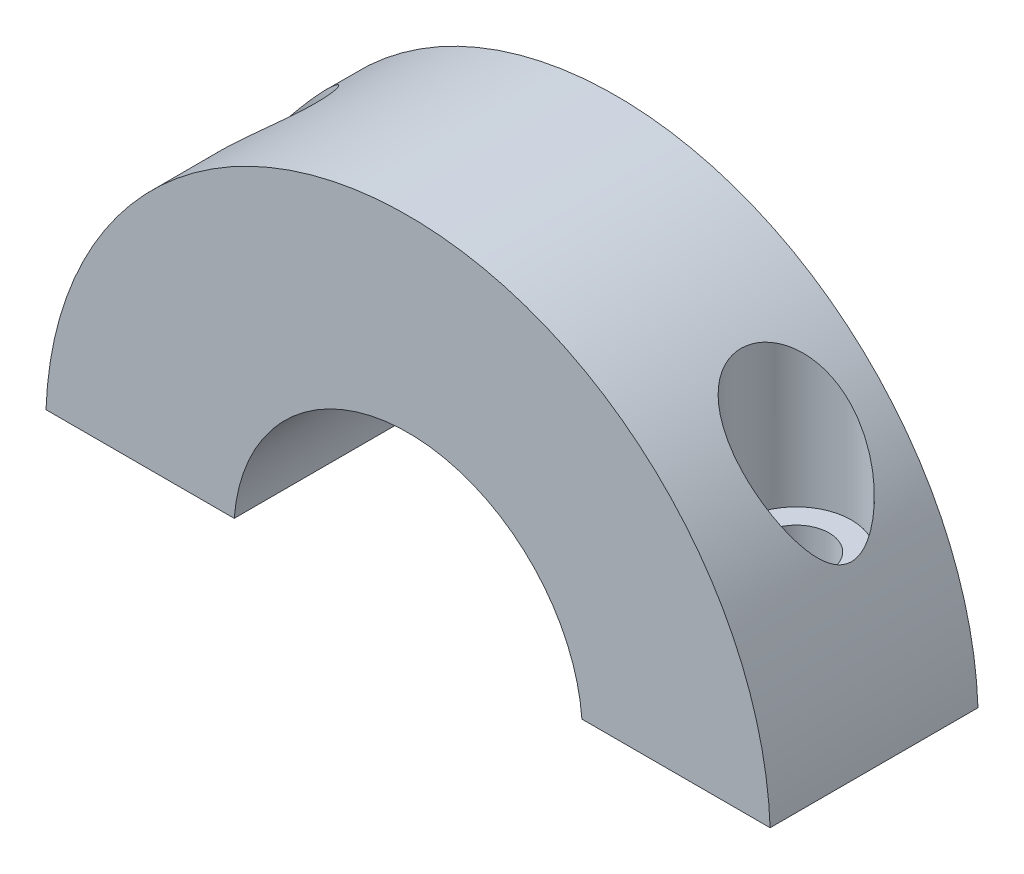
ISO-10303-21;
HEADER;
FILE_DESCRIPTION(('STEP AP214'),'2;1');
FILE_NAME('part.step','',(''),(''),'','','');
FILE_SCHEMA(('AUTOMOTIVE_DESIGN { 1 0 10303 214 1 1 1 1 }'));
ENDSEC;
DATA;
#1=APPLICATION_CONTEXT('core data for automotive mechanical design processes');
#2=APPLICATION_PROTOCOL_DEFINITION('international standard','automotive_design',2000,#1);
#3=PRODUCT_CONTEXT('',#1,'mechanical');
#4=PRODUCT('Part','Part','',(#3));
#5=PRODUCT_RELATED_PRODUCT_CATEGORY('part','',(#4));
#6=PRODUCT_DEFINITION_FORMATION('','',#4);
#7=PRODUCT_DEFINITION_CONTEXT('part definition',#1,'design');
#8=PRODUCT_DEFINITION('design','',#6,#7);
#9=PRODUCT_DEFINITION_SHAPE('','',#8);
#10=(LENGTH_UNIT() NAMED_UNIT(*) SI_UNIT(.MILLI.,.METRE.));
#11=(NAMED_UNIT(*) PLANE_ANGLE_UNIT() SI_UNIT($,.RADIAN.));
#12=(NAMED_UNIT(*) SI_UNIT($,.STERADIAN.) SOLID_ANGLE_UNIT());
#13=UNCERTAINTY_MEASURE_WITH_UNIT(LENGTH_MEASURE(1.E-05),#10,'distance_accuracy_value','');
#14=(GEOMETRIC_REPRESENTATION_CONTEXT(3) GLOBAL_UNCERTAINTY_ASSIGNED_CONTEXT((#13)) GLOBAL_UNIT_ASSIGNED_CONTEXT((#10,
#11,#12)) REPRESENTATION_CONTEXT('',''));
#15=CARTESIAN_POINT('',(0.,0.,0.));
#16=DIRECTION('',(0.,0.,1.));
#17=DIRECTION('',(1.,0.,0.));
#18=AXIS2_PLACEMENT_3D('',#15,#16,#17);
#19=CARTESIAN_POINT('',(0.,62.,8.));
#20=DIRECTION('',(0.,0.,-1.));
#21=DIRECTION('',(-1.,0.,0.));
#22=AXIS2_PLACEMENT_3D('',#19,#20,#21);
#23=CYLINDRICAL_SURFACE('',#22,27.536401);
#24=DIRECTION('',(0.,0.,-1.));
#25=VECTOR('',#24,1.);
#26=CARTESIAN_POINT('',(-27.5182372261161,63.,8.));
#27=LINE('',#26,#25);
#28=CARTESIAN_POINT('',(-27.5182372261161,63.,7.8));
#29=VERTEX_POINT('',#28);
#30=CARTESIAN_POINT('',(-27.5182372261161,63.,-8.));
#31=VERTEX_POINT('',#30);
#32=EDGE_CURVE('E51',#29,#31,#27,.T.);
#33=ORIENTED_EDGE('',*,*,#32,.F.);
#34=CARTESIAN_POINT('',(0.,62.,7.8));
#35=DIRECTION('',(0.,0.,1.));
#36=DIRECTION('',(1.,0.,0.));
#37=AXIS2_PLACEMENT_3D('',#34,#35,#36);
#38=CIRCLE('',#37,27.536401);
#39=CARTESIAN_POINT('',(27.5182372261161,63.,7.8));
#40=VERTEX_POINT('',#39);
#41=EDGE_CURVE('E89',#40,#29,#38,.T.);
#42=ORIENTED_EDGE('',*,*,#41,.F.);
#43=DIRECTION('',(0.,0.,-1.));
#44=VECTOR('',#43,1.);
#45=CARTESIAN_POINT('',(27.5182372261161,63.,8.));
#46=LINE('',#45,#44);
#47=CARTESIAN_POINT('',(27.5182372261161,63.,-8.));
#48=VERTEX_POINT('',#47);
#49=EDGE_CURVE('E11',#40,#48,#46,.T.);
#50=ORIENTED_EDGE('',*,*,#49,.T.);
#51=CARTESIAN_POINT('',(0.,62.,-8.));
#52=DIRECTION('',(0.,0.,1.));
#53=DIRECTION('',(1.,0.,0.));
#54=AXIS2_PLACEMENT_3D('',#51,#52,#53);
#55=CIRCLE('',#54,27.536401);
#56=EDGE_CURVE('E91',#48,#31,#55,.T.);
#57=ORIENTED_EDGE('',*,*,#56,.T.);
#58=EDGE_LOOP('',(#33,#42,#50,#57));
#59=FACE_BOUND('',#58,.T.);
#60=CARTESIAN_POINT('',(20.3554108455631,80.5448275629927,2.85));
#61=CARTESIAN_POINT('',(20.1170856780255,80.8064138873863,2.85000491122155));
#62=CARTESIAN_POINT('',(19.8734882162015,81.0636182927769,2.82976416768837));
#63=CARTESIAN_POINT('',(19.380286353609,81.5648000280252,2.74290249329211));
#64=CARTESIAN_POINT('',(19.1306778279491,81.8087678783834,2.67624878382171));
#65=CARTESIAN_POINT('',(18.668615235094,82.2440637222647,2.5031203518999));
#66=CARTESIAN_POINT('',(18.4559531339109,82.4379299118321,2.40370442704971));
#67=CARTESIAN_POINT('',(18.0390312266731,82.8068229357384,2.1617422833961));
#68=CARTESIAN_POINT('',(17.8347594094006,82.9818773255289,2.01926034783478));
#69=CARTESIAN_POINT('',(17.4817471963152,83.2763784605357,1.71997945018841));
#70=CARTESIAN_POINT('',(17.3298636914924,83.4000544056243,1.57114748672686));
#71=CARTESIAN_POINT('',(17.1160765193174,83.5708530588488,1.32554406533209));
#72=CARTESIAN_POINT('',(17.0471232526477,83.6253566578556,1.23990255568893));
#73=CARTESIAN_POINT('',(16.9148272837995,83.7289907125216,1.06137109727708));
#74=CARTESIAN_POINT('',(16.8514820201815,83.7781236236596,0.968484494532941));
#75=CARTESIAN_POINT('',(16.7307823766533,83.870989068267,0.774900709801326));
#76=CARTESIAN_POINT('',(16.6734900401528,83.9146663806434,0.67413820448889));
#77=CARTESIAN_POINT('',(16.566605094783,83.995578387015,0.466206146089017));
#78=CARTESIAN_POINT('',(16.5170083527228,84.0328165406263,0.359040075403063));
#79=CARTESIAN_POINT('',(16.4264488870721,84.1004152152436,0.139092111326543));
#80=CARTESIAN_POINT('',(16.3854819970795,84.1307790556276,0.0263129605359359));
#81=CARTESIAN_POINT('',(16.3130081760781,84.1842551938385,-0.203904657080799));
#82=CARTESIAN_POINT('',(16.2814993810062,84.2073689206055,-0.321342200628196));
#83=CARTESIAN_POINT('',(16.2325691618508,84.2431529199722,-0.541930864079826));
#84=CARTESIAN_POINT('',(16.2137487202528,84.2568657606456,-0.644605517233662));
#85=CARTESIAN_POINT('',(16.1837700874471,84.2786739266966,-0.851652330382076));
#86=CARTESIAN_POINT('',(16.1726109700414,84.2867699311101,-0.956024283623202));
#87=CARTESIAN_POINT('',(16.1581498244615,84.2972566544237,-1.16554735382866));
#88=CARTESIAN_POINT('',(16.1548441716258,84.299650005309,-1.27069808886892));
#89=CARTESIAN_POINT('',(16.1561361349395,84.2987139979019,-1.48092278105756));
#90=CARTESIAN_POINT('',(16.1607334444733,84.295384861628,-1.58599674102639));
#91=CARTESIAN_POINT('',(16.1770345299133,84.2835595351157,-1.78634999472077));
#92=CARTESIAN_POINT('',(16.1881065931376,84.2755225618938,-1.88170830509568));
#93=CARTESIAN_POINT('',(16.2166427934159,84.2547563202577,-2.07095401251112));
#94=CARTESIAN_POINT('',(16.2341089266851,84.2420255864524,-2.16484094063323));
#95=CARTESIAN_POINT('',(16.2957528383696,84.1969474904657,-2.44324923268322));
#96=CARTESIAN_POINT('',(16.349193828075,84.1577016509412,-2.6247277767167));
#97=CARTESIAN_POINT('',(16.4792657060671,84.0611378229269,-2.97844031862068));
#98=CARTESIAN_POINT('',(16.5563557551187,84.0034609667016,-3.15040356985124));
#99=CARTESIAN_POINT('',(16.7295511915867,83.8720665960674,-3.47778189550233));
#100=CARTESIAN_POINT('',(16.8256620861616,83.7983444353986,-3.63319215719706));
#101=CARTESIAN_POINT('',(17.0439826397396,83.6281551466352,-3.94109392597375));
#102=CARTESIAN_POINT('',(17.1678835801563,83.5300995007122,-4.09149978296373));
#103=CARTESIAN_POINT('',(17.4289209882972,83.319341964941,-4.36860392403431));
#104=CARTESIAN_POINT('',(17.566066148701,83.2066304388439,-4.49528647511208));
#105=CARTESIAN_POINT('',(17.9172985887685,82.9116787110772,-4.78053124604048));
#106=CARTESIAN_POINT('',(18.1366375684362,82.72209166657,-4.92507334204503));
#107=CARTESIAN_POINT('',(18.5831730361553,82.3226282204481,-5.16626154425809));
#108=CARTESIAN_POINT('',(18.8103844276671,82.1127118143169,-5.26281082321963));
#109=CARTESIAN_POINT('',(19.191965743328,81.7476033699204,-5.38892002801711));
#110=CARTESIAN_POINT('',(19.3464463068178,81.5963205368177,-5.43002494451777));
#111=CARTESIAN_POINT('',(19.6536964697715,81.2881543021489,-5.49393867753899));
#112=CARTESIAN_POINT('',(19.8064654490179,81.131268951498,-5.51674106064946));
#113=CARTESIAN_POINT('',(20.1091292237962,80.8128850412707,-5.54553219762963));
#114=CARTESIAN_POINT('',(20.2590197107308,80.6513803492698,-5.55149744281213));
#115=CARTESIAN_POINT('',(20.5547658069414,80.3249422348918,-5.54787148886979));
#116=CARTESIAN_POINT('',(20.7006214886965,80.1600088741988,-5.53828056937202));
#117=CARTESIAN_POINT('',(21.0303661581456,79.7780272613583,-5.49965201338604));
#118=CARTESIAN_POINT('',(21.2126487542574,79.5600839435396,-5.46567441065311));
#119=CARTESIAN_POINT('',(21.568231008172,79.121465141371,-5.37526285702806));
#120=CARTESIAN_POINT('',(21.7415269481517,78.9007885723014,-5.31881969448703));
#121=CARTESIAN_POINT('',(22.0783318664669,78.458370493922,-5.18463391077016));
#122=CARTESIAN_POINT('',(22.2418382906509,78.2366287228546,-5.10688576023069));
#123=CARTESIAN_POINT('',(22.5582848706379,77.794020426795,-4.9305261469698));
#124=CARTESIAN_POINT('',(22.7112299267302,77.573153541326,-4.83192444738871));
#125=CARTESIAN_POINT('',(22.95274769027,77.2135914222268,-4.65266388135411));
#126=CARTESIAN_POINT('',(23.0446625709733,77.073955863766,-4.57833619132526));
#127=CARTESIAN_POINT('',(23.2235987035677,76.7967910096607,-4.42046252586134));
#128=CARTESIAN_POINT('',(23.3106209480897,76.659261290928,-4.33691843053717));
#129=CARTESIAN_POINT('',(23.4792381842448,76.387642203923,-4.16008974798037));
#130=CARTESIAN_POINT('',(23.560843876028,76.2535463949556,-4.06682536055649));
#131=CARTESIAN_POINT('',(23.718223744995,75.9900951030037,-3.8694085377114));
#132=CARTESIAN_POINT('',(23.794000886173,75.860737228404,-3.76526170075306));
#133=CARTESIAN_POINT('',(23.9456643841948,75.5971952706102,-3.53425095106459));
#134=CARTESIAN_POINT('',(24.0209010653968,75.4636872700116,-3.40617406725149));
#135=CARTESIAN_POINT('',(24.1614954657254,75.2097111784723,-3.13251964405693));
#136=CARTESIAN_POINT('',(24.2268596619022,75.0892345528847,-2.98695369230382));
#137=CARTESIAN_POINT('',(24.3288336346442,74.8984392226132,-2.71636391090242));
#138=CARTESIAN_POINT('',(24.3684876926555,74.8232550724606,-2.59597568595176));
#139=CARTESIAN_POINT('',(24.4382800159966,74.6897405577044,-2.34359088604159));
#140=CARTESIAN_POINT('',(24.4684379062772,74.6313754560268,-2.21161898203924));
#141=CARTESIAN_POINT('',(24.5108885738001,74.5487601163271,-1.96921639683624));
#142=CARTESIAN_POINT('',(24.525701701723,74.5197387393759,-1.86087978656766));
#143=CARTESIAN_POINT('',(24.5468266786549,74.4782707502451,-1.64028270216516));
#144=CARTESIAN_POINT('',(24.5531482047998,74.46580527094,-1.52802684445828));
#145=CARTESIAN_POINT('',(24.5566596311963,74.4588871942378,-1.30247908672344));
#146=CARTESIAN_POINT('',(24.5538236481471,74.4644856537429,-1.18918515417137));
#147=CARTESIAN_POINT('',(24.5392721018544,74.4931077754026,-0.965396045315587));
#148=CARTESIAN_POINT('',(24.5275484193767,74.5161473706367,-0.854903523639996));
#149=CARTESIAN_POINT('',(24.4922764289695,74.5850549780343,-0.611706542477021));
#150=CARTESIAN_POINT('',(24.4664648319345,74.6352656840766,-0.480583779149061));
#151=CARTESIAN_POINT('',(24.4051294984607,74.7533299360545,-0.228991550867266));
#152=CARTESIAN_POINT('',(24.3695840438463,74.8212229178955,-0.108546715581749));
#153=CARTESIAN_POINT('',(24.2979145684377,74.9564477339296,0.101453786478107));
#154=CARTESIAN_POINT('',(24.2629784624694,75.0218019567923,0.19272808884908));
#155=CARTESIAN_POINT('',(24.1888962758415,75.1589038106986,0.368574983962363));
#156=CARTESIAN_POINT('',(24.1497472988413,75.2306558343331,0.453142895794826));
#157=CARTESIAN_POINT('',(24.0678391548043,75.3790769105067,0.616271227514674));
#158=CARTESIAN_POINT('',(24.0250730900095,75.45575528747,0.69481959884788));
#159=CARTESIAN_POINT('',(23.9364502104395,75.612783698775,0.846327200077426));
#160=CARTESIAN_POINT('',(23.8905922503332,75.6931350901232,0.919284337191646));
#161=CARTESIAN_POINT('',(23.7541036427421,75.9293817708304,1.12277584440249));
#162=CARTESIAN_POINT('',(23.6599408776209,76.088880385686,1.24678130789373));
#163=CARTESIAN_POINT('',(23.4632723436922,76.4140369390714,1.47919646724113));
#164=CARTESIAN_POINT('',(23.3607595637816,76.5796999888532,1.58759284108651));
#165=CARTESIAN_POINT('',(23.1480841952875,76.9150617907301,1.79047758661796));
#166=CARTESIAN_POINT('',(23.0379087933341,77.0847669746458,1.88494179614302));
#167=CARTESIAN_POINT('',(22.8106523407903,77.4262631956377,2.0606306716207));
#168=CARTESIAN_POINT('',(22.6935734794542,77.5980535578745,2.14185950440605));
#169=CARTESIAN_POINT('',(22.442396620416,77.9575807369777,2.29804338366611));
#170=CARTESIAN_POINT('',(22.3077038370733,78.1454058256043,2.37183956386698));
#171=CARTESIAN_POINT('',(22.0309630145636,78.521031720584,2.50435601784821));
#172=CARTESIAN_POINT('',(21.8889131483285,78.7088325091814,2.56307252493977));
#173=CARTESIAN_POINT('',(21.5983654520934,79.0827362699889,2.66480785135605));
#174=CARTESIAN_POINT('',(21.4498887508604,79.2688426840979,2.70787429810607));
#175=CARTESIAN_POINT('',(21.1466508675086,79.6388689670071,2.77772695728788));
#176=CARTESIAN_POINT('',(20.9918931169848,79.8227899606337,2.80452193508563));
#177=CARTESIAN_POINT('',(20.755857095028,80.0959165040667,2.83161181954887));
#178=CARTESIAN_POINT('',(20.6766856074354,80.186327068475,2.83845735009266));
#179=CARTESIAN_POINT('',(20.5170170179507,80.366270433863,2.84765176002859));
#180=CARTESIAN_POINT('',(20.4365192562302,80.4558027602702,2.84999832858032));
#181=CARTESIAN_POINT('',(20.3554108455631,80.5448275629927,2.85));
#182=B_SPLINE_CURVE_WITH_KNOTS('',3,(#60,#61,#62,#63,#64,#65,#66,#67,#68,#69,#70,#71,#72,#73,
#74,#75,#76,#77,#78,#79,#80,#81,#82,#83,#84,#85,#86,#87,#88,#89,#90,#91,#92,#93,#94,#95,#96,#97,
#98,#99,#100,#101,#102,#103,#104,#105,#106,#107,#108,#109,#110,#111,#112,#113,#114,#115,#116,
#117,#118,#119,#120,#121,#122,#123,#124,#125,#126,#127,#128,#129,#130,#131,#132,#133,#134,#135,
#136,#137,#138,#139,#140,#141,#142,#143,#144,#145,#146,#147,#148,#149,#150,#151,#152,#153,#154,
#155,#156,#157,#158,#159,#160,#161,#162,#163,#164,#165,#166,#167,#168,#169,#170,#171,#172,#173,
#174,#175,#176,#177,#178,#179,#180,#181),.UNSPECIFIED.,.T.,.F.,(4,2,2,2,2,2,2,2,2,2,2,2,2,2,2,2,
2,2,2,2,2,2,2,2,2,2,2,2,2,2,2,2,2,2,2,2,2,2,2,2,2,2,2,2,2,2,2,2,2,2,2,2,2,2,2,2,2,2,2,2,4),(0.,
1.06135899275006,2.12346831895941,3.03367092155263,3.9425215479576,4.67732523600955,
5.0450902329951,5.41268637826676,5.78374467824035,6.15460299321725,6.52528184924406,
6.89588760142157,7.21131046540697,7.52669519035481,7.84193432539933,8.15716123021393,
8.44581583350506,8.73456063111331,9.31142567398329,9.90028762741821,10.4893203257917,
11.1412825960226,11.7936757200906,12.7601948062652,13.7286560443854,14.3881173235907,
15.0478103045557,15.7084239207598,16.3690256623522,17.2263210832955,18.0839683874503,
18.9418384911962,19.7993078459575,20.3478973250848,20.8963751003076,21.4437349858486,
21.9908146563382,22.5889459748557,23.1866831561472,23.6275409880786,24.0674816630959,
24.4054850285868,24.7431028734831,25.0816758148995,25.4205584281998,25.8464578089626,
26.2733153094619,26.625535518667,26.9779994445931,27.3311513634432,27.6844348268719,
28.3520589150505,29.0202494706067,29.6895855574059,30.3587105113427,31.0859911445853,
31.8134532659311,32.538682604052,33.2635209170705,33.6245443029357,33.9857530747103),.UNSPECIFIED.);
#183=CARTESIAN_POINT('',(20.3554108455631,80.5448275629927,2.85));
#184=VERTEX_POINT('',#183);
#185=EDGE_CURVE('E117',#184,#184,#182,.T.);
#186=ORIENTED_EDGE('',*,*,#185,.T.);
#187=EDGE_LOOP('',(#186));
#188=FACE_BOUND('',#187,.T.);
#189=CARTESIAN_POINT('',(-20.3554108455638,80.5448275629919,2.85));
#190=CARTESIAN_POINT('',(-20.1170856780262,80.8064138873855,2.85000491122155));
#191=CARTESIAN_POINT('',(-19.8734882162022,81.0636182927762,2.82976416768838));
#192=CARTESIAN_POINT('',(-19.3802863536097,81.5648000280244,2.74290249329212));
#193=CARTESIAN_POINT('',(-19.1306778279499,81.8087678783826,2.67624878382173));
#194=CARTESIAN_POINT('',(-18.6686152350948,82.244063722264,2.50312035189993));
#195=CARTESIAN_POINT('',(-18.4559531339117,82.4379299118314,2.40370442704975));
#196=CARTESIAN_POINT('',(-18.0390312266739,82.8068229357377,2.16174228339613));
#197=CARTESIAN_POINT('',(-17.8347594094014,82.9818773255282,2.01926034783482));
#198=CARTESIAN_POINT('',(-17.4817471963159,83.2763784605351,1.71997945018846));
#199=CARTESIAN_POINT('',(-17.3298636914932,83.4000544056236,1.57114748672691));
#200=CARTESIAN_POINT('',(-17.1160765193182,83.5708530588482,1.32554406533215));
#201=CARTESIAN_POINT('',(-17.0471232526484,83.625356657855,1.23990255568899));
#202=CARTESIAN_POINT('',(-16.9148272838003,83.7289907125211,1.06137109727714));
#203=CARTESIAN_POINT('',(-16.8514820201822,83.778123623659,0.968484494532999));
#204=CARTESIAN_POINT('',(-16.730782376654,83.8709890682664,0.774900709801388));
#205=CARTESIAN_POINT('',(-16.6734900401535,83.9146663806429,0.674138204488953));
#206=CARTESIAN_POINT('',(-16.5666050947837,83.9955783870144,0.466206146089081));
#207=CARTESIAN_POINT('',(-16.5170083527235,84.0328165406257,0.359040075403125));
#208=CARTESIAN_POINT('',(-16.4264488870728,84.100415215243,0.139092111326602));
#209=CARTESIAN_POINT('',(-16.3854819970802,84.130779055627,0.0263129605359941));
#210=CARTESIAN_POINT('',(-16.3130081760788,84.1842551938379,-0.203904657080742));
#211=CARTESIAN_POINT('',(-16.2814993810069,84.207368920605,-0.321342200628139));
#212=CARTESIAN_POINT('',(-16.2325691618515,84.2431529199716,-0.541930864079769));
#213=CARTESIAN_POINT('',(-16.2137487202535,84.256865760645,-0.644605517233605));
#214=CARTESIAN_POINT('',(-16.1837700874479,84.2786739266961,-0.851652330382018));
#215=CARTESIAN_POINT('',(-16.1726109700421,84.2867699311095,-0.956024283623144));
#216=CARTESIAN_POINT('',(-16.1581498244622,84.2972566544232,-1.1655473538286));
#217=CARTESIAN_POINT('',(-16.1548441716265,84.2996500053085,-1.27069808886886));
#218=CARTESIAN_POINT('',(-16.1561361349402,84.2987139979013,-1.4809227810575));
#219=CARTESIAN_POINT('',(-16.160733444474,84.2953848616275,-1.58599674102633));
#220=CARTESIAN_POINT('',(-16.1770345299141,84.2835595351151,-1.78634999472071));
#221=CARTESIAN_POINT('',(-16.1881065931384,84.2755225618933,-1.88170830509562));
#222=CARTESIAN_POINT('',(-16.2166427934166,84.2547563202572,-2.07095401251105));
#223=CARTESIAN_POINT('',(-16.2341089266858,84.2420255864519,-2.16484094063316));
#224=CARTESIAN_POINT('',(-16.2957528383703,84.1969474904652,-2.44324923268315));
#225=CARTESIAN_POINT('',(-16.3491938280757,84.1577016509407,-2.62472777671662));
#226=CARTESIAN_POINT('',(-16.4792657060677,84.0611378229263,-2.9784403186206));
#227=CARTESIAN_POINT('',(-16.5563557551194,84.0034609667011,-3.15040356985115));
#228=CARTESIAN_POINT('',(-16.7295511915874,83.8720665960669,-3.47778189550225));
#229=CARTESIAN_POINT('',(-16.8256620861623,83.7983444353981,-3.63319215719697));
#230=CARTESIAN_POINT('',(-17.0439826397403,83.6281551466346,-3.94109392597366));
#231=CARTESIAN_POINT('',(-17.1678835801569,83.5300995007117,-4.09149978296365));
#232=CARTESIAN_POINT('',(-17.4289209882979,83.3193419649405,-4.36860392403422));
#233=CARTESIAN_POINT('',(-17.5660661487017,83.2066304388433,-4.49528647511199));
#234=CARTESIAN_POINT('',(-17.9172985887691,82.9116787110766,-4.7805312460404));
#235=CARTESIAN_POINT('',(-18.1366375684369,82.7220916665694,-4.92507334204496));
#236=CARTESIAN_POINT('',(-18.5831730361559,82.3226282204475,-5.16626154425804));
#237=CARTESIAN_POINT('',(-18.8103844276677,82.1127118143164,-5.26281082321958));
#238=CARTESIAN_POINT('',(-19.1919657433286,81.7476033699198,-5.38892002801706));
#239=CARTESIAN_POINT('',(-19.3464463068184,81.5963205368171,-5.43002494451773));
#240=CARTESIAN_POINT('',(-19.6536964697721,81.2881543021483,-5.49393867753896));
#241=CARTESIAN_POINT('',(-19.8064654490185,81.1312689514974,-5.51674106064944));
#242=CARTESIAN_POINT('',(-20.1091292237968,80.8128850412701,-5.54553219762961));
#243=CARTESIAN_POINT('',(-20.2590197107314,80.6513803492691,-5.55149744281212));
#244=CARTESIAN_POINT('',(-20.554765806942,80.3249422348911,-5.54787148886979));
#245=CARTESIAN_POINT('',(-20.7006214886971,80.1600088741981,-5.53828056937202));
#246=CARTESIAN_POINT('',(-21.0303661581462,79.7780272613576,-5.49965201338605));
#247=CARTESIAN_POINT('',(-21.212648754258,79.5600839435389,-5.46567441065313));
#248=CARTESIAN_POINT('',(-21.5682310081727,79.1214651413702,-5.37526285702808));
#249=CARTESIAN_POINT('',(-21.7415269481523,78.9007885723005,-5.31881969448705));
#250=CARTESIAN_POINT('',(-22.0783318664676,78.4583704939211,-5.18463391077018));
#251=CARTESIAN_POINT('',(-22.2418382906515,78.2366287228537,-5.10688576023072));
#252=CARTESIAN_POINT('',(-22.5582848706385,77.794020426794,-4.93052614696982));
#253=CARTESIAN_POINT('',(-22.7112299267308,77.573153541325,-4.83192444738873));
#254=CARTESIAN_POINT('',(-22.9527476902707,77.2135914222258,-4.65266388135413));
#255=CARTESIAN_POINT('',(-23.044662570974,77.073955863765,-4.57833619132528));
#256=CARTESIAN_POINT('',(-23.2235987035684,76.7967910096596,-4.42046252586135));
#257=CARTESIAN_POINT('',(-23.3106209480904,76.6592612909269,-4.33691843053718));
#258=CARTESIAN_POINT('',(-23.4792381842455,76.3876422039219,-4.16008974798038));
#259=CARTESIAN_POINT('',(-23.5608438760287,76.2535463949544,-4.06682536055649));
#260=CARTESIAN_POINT('',(-23.7182237449957,75.9900951030024,-3.86940853771139));
#261=CARTESIAN_POINT('',(-23.7940008861737,75.8607372284028,-3.76526170075306));
#262=CARTESIAN_POINT('',(-23.9456643841955,75.597195270609,-3.53425095106459));
#263=CARTESIAN_POINT('',(-24.0209010653975,75.4636872700103,-3.4061740672515));
#264=CARTESIAN_POINT('',(-24.1614954657261,75.209711178471,-3.13251964405695));
#265=CARTESIAN_POINT('',(-24.2268596619029,75.0892345528834,-2.98695369230386));
#266=CARTESIAN_POINT('',(-24.3288336346449,74.8984392226119,-2.71636391090247));
#267=CARTESIAN_POINT('',(-24.3684876926562,74.8232550724592,-2.59597568595182));
#268=CARTESIAN_POINT('',(-24.4382800159973,74.6897405577031,-2.34359088604166));
#269=CARTESIAN_POINT('',(-24.4684379062779,74.6313754560255,-2.21161898203931));
#270=CARTESIAN_POINT('',(-24.5108885738008,74.5487601163257,-1.96921639683632));
#271=CARTESIAN_POINT('',(-24.5257017017237,74.5197387393745,-1.86087978656776));
#272=CARTESIAN_POINT('',(-24.5468266786556,74.4782707502437,-1.64028270216528));
#273=CARTESIAN_POINT('',(-24.5531482048005,74.4658052709386,-1.52802684445841));
#274=CARTESIAN_POINT('',(-24.556659631197,74.4588871942364,-1.30247908672359));
#275=CARTESIAN_POINT('',(-24.5538236481478,74.4644856537415,-1.18918515417153));
#276=CARTESIAN_POINT('',(-24.5392721018552,74.4931077754011,-0.965396045315761));
#277=CARTESIAN_POINT('',(-24.5275484193774,74.5161473706353,-0.85490352364018));
#278=CARTESIAN_POINT('',(-24.4922764289702,74.5850549780328,-0.611706542477228));
#279=CARTESIAN_POINT('',(-24.4664648319353,74.6352656840752,-0.480583779149278));
#280=CARTESIAN_POINT('',(-24.4051294984615,74.7533299360529,-0.228991550867516));
#281=CARTESIAN_POINT('',(-24.3695840438471,74.821222917894,-0.108546715582021));
#282=CARTESIAN_POINT('',(-24.2979145684385,74.956447733928,0.101453786477802));
#283=CARTESIAN_POINT('',(-24.2629784624703,75.0218019567907,0.192728088848762));
#284=CARTESIAN_POINT('',(-24.1888962758424,75.158903810697,0.36857498396202));
#285=CARTESIAN_POINT('',(-24.1497472988422,75.2306558343315,0.453142895794471));
#286=CARTESIAN_POINT('',(-24.0678391548052,75.379076910505,0.616271227514302));
#287=CARTESIAN_POINT('',(-24.0250730900104,75.4557552874684,0.694819598847505));
#288=CARTESIAN_POINT('',(-23.9364502104405,75.6127836987733,0.846327200077035));
#289=CARTESIAN_POINT('',(-23.8905922503341,75.6931350901215,0.919284337191243));
#290=CARTESIAN_POINT('',(-23.7541036427431,75.9293817708287,1.12277584440208));
#291=CARTESIAN_POINT('',(-23.6599408776219,76.0888803856842,1.24678130789333));
#292=CARTESIAN_POINT('',(-23.4632723436932,76.4140369390697,1.47919646724073));
#293=CARTESIAN_POINT('',(-23.3607595637827,76.5796999888515,1.58759284108612));
#294=CARTESIAN_POINT('',(-23.1480841952886,76.9150617907283,1.79047758661758));
#295=CARTESIAN_POINT('',(-23.0379087933353,77.084766974644,1.88494179614265));
#296=CARTESIAN_POINT('',(-22.8106523407915,77.4262631956359,2.06063067162034));
#297=CARTESIAN_POINT('',(-22.6935734794554,77.5980535578727,2.14185950440569));
#298=CARTESIAN_POINT('',(-22.4423966204174,77.9575807369758,2.29804338366578));
#299=CARTESIAN_POINT('',(-22.3077038370746,78.1454058256024,2.37183956386666));
#300=CARTESIAN_POINT('',(-22.030963014565,78.5210317205822,2.50435601784793));
#301=CARTESIAN_POINT('',(-21.8889131483299,78.7088325091796,2.5630725249395));
#302=CARTESIAN_POINT('',(-21.5983654520949,79.082736269987,2.66480785135583));
#303=CARTESIAN_POINT('',(-21.4498887508619,79.2688426840961,2.70787429810587));
#304=CARTESIAN_POINT('',(-21.1466508675102,79.6388689670053,2.77772695728772));
#305=CARTESIAN_POINT('',(-20.9918931169864,79.8227899606318,2.80452193508551));
#306=CARTESIAN_POINT('',(-20.7558570950294,80.095916504065,2.83161181954881));
#307=CARTESIAN_POINT('',(-20.6766856074367,80.1863270684735,2.83845735009262));
#308=CARTESIAN_POINT('',(-20.5170170179517,80.3662704338618,2.84765176002858));
#309=CARTESIAN_POINT('',(-20.4365192562311,80.4558027602693,2.84999832858033));
#310=CARTESIAN_POINT('',(-20.3554108455638,80.5448275629919,2.85));
#311=B_SPLINE_CURVE_WITH_KNOTS('',3,(#189,#190,#191,#192,#193,#194,#195,#196,#197,#198,#199,
#200,#201,#202,#203,#204,#205,#206,#207,#208,#209,#210,#211,#212,#213,#214,#215,#216,#217,#218,
#219,#220,#221,#222,#223,#224,#225,#226,#227,#228,#229,#230,#231,#232,#233,#234,#235,#236,#237,
#238,#239,#240,#241,#242,#243,#244,#245,#246,#247,#248,#249,#250,#251,#252,#253,#254,#255,#256,
#257,#258,#259,#260,#261,#262,#263,#264,#265,#266,#267,#268,#269,#270,#271,#272,#273,#274,#275,
#276,#277,#278,#279,#280,#281,#282,#283,#284,#285,#286,#287,#288,#289,#290,#291,#292,#293,#294,
#295,#296,#297,#298,#299,#300,#301,#302,#303,#304,#305,#306,#307,#308,#309,#310),.UNSPECIFIED.,
.T.,.F.,(4,2,2,2,2,2,2,2,2,2,2,2,2,2,2,2,2,2,2,2,2,2,2,2,2,2,2,2,2,2,2,2,2,2,2,2,2,2,2,2,2,2,2,
2,2,2,2,2,2,2,2,2,2,2,2,2,2,2,2,2,4),(0.,1.06135899275008,2.12346831895941,3.03367092155265,
3.94252154795766,4.67732523600962,5.04509023299517,5.41268637826684,5.78374467824043,
6.15460299321734,6.52528184924416,6.89588760142167,7.21131046540707,7.52669519035491,
7.84193432539944,8.15716123021403,8.44581583350516,8.7345606311134,9.31142567398336,
9.90028762741828,10.4893203257917,11.1412825960226,11.7936757200907,12.7601948062652,
13.7286560443855,14.3881173235907,15.0478103045558,15.7084239207599,16.3690256623524,
17.2263210832958,18.0839683874506,18.9418384911966,19.799307845958,20.3478973250853,
20.8963751003082,21.4437349858492,21.9908146563388,22.5889459748564,23.1866831561478,
23.6275409880792,24.0674816630965,24.4054850285875,24.7431028734837,25.0816758149001,
25.4205584282003,25.8464578089631,26.2733153094623,26.6255355186673,26.9779994445934,
27.3311513634434,27.6844348268721,28.3520589150506,29.0202494706067,29.6895855574059,
30.3587105113426,31.0859911445852,31.813453265931,32.5386826040518,33.2635209170703,
33.6245443029362,33.9857530747115),.UNSPECIFIED.);
#312=CARTESIAN_POINT('',(-20.3554108455638,80.5448275629919,2.85));
#313=VERTEX_POINT('',#312);
#314=EDGE_CURVE('E42',#313,#313,#311,.T.);
#315=ORIENTED_EDGE('',*,*,#314,.F.);
#316=EDGE_LOOP('',(#315));
#317=FACE_BOUND('',#316,.T.);
#318=ADVANCED_FACE('F38',(#59,#188,#317),#23,.T.);
#319=CARTESIAN_POINT('',(2.44456587162445E-13,63.0000000000001,8.));
#320=DIRECTION('',(0.,1.,0.));
#321=DIRECTION('',(-1.,0.,0.));
#322=AXIS2_PLACEMENT_3D('',#319,#320,#321);
#323=PLANE('',#322);
#324=CARTESIAN_POINT('',(20.3554108455631,63.,-1.35));
#325=DIRECTION('',(0.,1.,0.));
#326=DIRECTION('',(-1.,0.,0.));
#327=AXIS2_PLACEMENT_3D('',#324,#325,#326);
#328=CIRCLE('',#327,2.5);
#329=CARTESIAN_POINT('',(17.8554108455631,63.,-1.35));
#330=VERTEX_POINT('',#329);
#331=EDGE_CURVE('E122',#330,#330,#328,.F.);
#332=ORIENTED_EDGE('',*,*,#331,.F.);
#333=EDGE_LOOP('',(#332));
#334=FACE_BOUND('',#333,.T.);
#335=ORIENTED_EDGE('',*,*,#49,.F.);
#336=DIRECTION('',(1.,0.,0.));
#337=VECTOR('',#336,1.);
#338=CARTESIAN_POINT('',(13.2122102617238,63.,7.8));
#339=LINE('',#338,#337);
#340=CARTESIAN_POINT('',(13.2122102617238,63.,7.8));
#341=VERTEX_POINT('',#340);
#342=EDGE_CURVE('E104',#341,#40,#339,.T.);
#343=ORIENTED_EDGE('',*,*,#342,.F.);
#344=DIRECTION('',(0.,0.,-1.));
#345=VECTOR('',#344,1.);
#346=CARTESIAN_POINT('',(13.2122102617238,63.0000000000001,8.));
#347=LINE('',#346,#345);
#348=CARTESIAN_POINT('',(13.2122102617238,63.0000000000001,-8.));
#349=VERTEX_POINT('',#348);
#350=EDGE_CURVE('E59',#341,#349,#347,.T.);
#351=ORIENTED_EDGE('',*,*,#350,.T.);
#352=DIRECTION('',(1.,0.,0.));
#353=VECTOR('',#352,1.);
#354=CARTESIAN_POINT('',(2.44456587162445E-13,63.0000000000001,-8.));
#355=LINE('',#354,#353);
#356=EDGE_CURVE('E125',#349,#48,#355,.T.);
#357=ORIENTED_EDGE('',*,*,#356,.T.);
#358=EDGE_LOOP('',(#335,#343,#351,#357));
#359=FACE_BOUND('',#358,.T.);
#360=ADVANCED_FACE('F40',(#334,#359),#323,.F.);
#361=CARTESIAN_POINT('',(-2.44456587162445E-13,63.0000000000001,8.));
#362=DIRECTION('',(0.,1.,0.));
#363=DIRECTION('',(-1.,0.,0.));
#364=AXIS2_PLACEMENT_3D('',#361,#362,#363);
#365=PLANE('',#364);
#366=CARTESIAN_POINT('',(-20.3554108455638,63.,-1.35));
#367=DIRECTION('',(0.,1.,0.));
#368=DIRECTION('',(-1.,0.,0.));
#369=AXIS2_PLACEMENT_3D('',#366,#367,#368);
#370=CIRCLE('',#369,2.5);
#371=CARTESIAN_POINT('',(-22.8554108455638,63.,-1.35));
#372=VERTEX_POINT('',#371);
#373=EDGE_CURVE('E126',#372,#372,#370,.F.);
#374=ORIENTED_EDGE('',*,*,#373,.F.);
#375=EDGE_LOOP('',(#374));
#376=FACE_BOUND('',#375,.T.);
#377=DIRECTION('',(0.,0.,-1.));
#378=VECTOR('',#377,1.);
#379=CARTESIAN_POINT('',(-13.2122102617238,63.0000000000001,8.));
#380=LINE('',#379,#378);
#381=CARTESIAN_POINT('',(-13.2122102617238,63.0000000000001,7.8));
#382=VERTEX_POINT('',#381);
#383=CARTESIAN_POINT('',(-13.2122102617238,63.0000000000001,-8.));
#384=VERTEX_POINT('',#383);
#385=EDGE_CURVE('E67',#382,#384,#380,.T.);
#386=ORIENTED_EDGE('',*,*,#385,.F.);
#387=DIRECTION('',(1.,0.,0.));
#388=VECTOR('',#387,1.);
#389=CARTESIAN_POINT('',(-27.5182372261161,63.,7.8));
#390=LINE('',#389,#388);
#391=EDGE_CURVE('E96',#29,#382,#390,.T.);
#392=ORIENTED_EDGE('',*,*,#391,.F.);
#393=ORIENTED_EDGE('',*,*,#32,.T.);
#394=DIRECTION('',(1.,0.,0.));
#395=VECTOR('',#394,1.);
#396=CARTESIAN_POINT('',(-2.44456587162445E-13,63.0000000000001,-8.));
#397=LINE('',#396,#395);
#398=EDGE_CURVE('E129',#31,#384,#397,.T.);
#399=ORIENTED_EDGE('',*,*,#398,.T.);
#400=EDGE_LOOP('',(#386,#392,#393,#399));
#401=FACE_BOUND('',#400,.T.);
#402=ADVANCED_FACE('F97',(#376,#401),#365,.F.);
#403=CARTESIAN_POINT('',(0.,62.,8.));
#404=DIRECTION('',(0.,0.,-1.));
#405=DIRECTION('',(-1.,0.,0.));
#406=AXIS2_PLACEMENT_3D('',#403,#404,#405);
#407=CYLINDRICAL_SURFACE('',#406,13.25);
#408=ORIENTED_EDGE('',*,*,#350,.F.);
#409=CARTESIAN_POINT('',(0.,62.,7.8));
#410=DIRECTION('',(0.,0.,-1.));
#411=DIRECTION('',(1.,0.,0.));
#412=AXIS2_PLACEMENT_3D('',#409,#410,#411);
#413=CIRCLE('',#412,13.25);
#414=EDGE_CURVE('E100',#382,#341,#413,.T.);
#415=ORIENTED_EDGE('',*,*,#414,.F.);
#416=ORIENTED_EDGE('',*,*,#385,.T.);
#417=CARTESIAN_POINT('',(0.,62.,-8.));
#418=DIRECTION('',(0.,0.,1.));
#419=DIRECTION('',(1.,0.,0.));
#420=AXIS2_PLACEMENT_3D('',#417,#418,#419);
#421=CIRCLE('',#420,13.25);
#422=EDGE_CURVE('E131',#349,#384,#421,.T.);
#423=ORIENTED_EDGE('',*,*,#422,.F.);
#424=EDGE_LOOP('',(#408,#415,#416,#423));
#425=FACE_BOUND('',#424,.T.);
#426=ADVANCED_FACE('F162',(#425),#407,.F.);
#427=CARTESIAN_POINT('',(0.,0.,-8.));
#428=DIRECTION('',(0.,0.,1.));
#429=DIRECTION('',(1.,0.,0.));
#430=AXIS2_PLACEMENT_3D('',#427,#428,#429);
#431=PLANE('',#430);
#432=ORIENTED_EDGE('',*,*,#356,.F.);
#433=ORIENTED_EDGE('',*,*,#422,.T.);
#434=ORIENTED_EDGE('',*,*,#398,.F.);
#435=ORIENTED_EDGE('',*,*,#56,.F.);
#436=EDGE_LOOP('',(#432,#433,#434,#435));
#437=FACE_BOUND('',#436,.T.);
#438=ADVANCED_FACE('F155',(#437),#431,.F.);
#439=CARTESIAN_POINT('',(-20.3554108455638,62.0000000000001,-1.35));
#440=DIRECTION('',(0.,1.,0.));
#441=DIRECTION('',(0.,0.,1.));
#442=AXIS2_PLACEMENT_3D('',#439,#440,#441);
#443=CYLINDRICAL_SURFACE('',#442,2.5);
#444=CARTESIAN_POINT('',(-20.3554108455638,73.0000000000001,-1.35));
#445=DIRECTION('',(0.,-1.,0.));
#446=DIRECTION('',(0.,0.,-1.));
#447=AXIS2_PLACEMENT_3D('',#444,#445,#446);
#448=CIRCLE('',#447,2.5);
#449=CARTESIAN_POINT('',(-20.3554108455638,73.0000000000001,-3.85));
#450=VERTEX_POINT('',#449);
#451=EDGE_CURVE('E110',#450,#450,#448,.T.);
#452=ORIENTED_EDGE('',*,*,#451,.F.);
#453=EDGE_LOOP('',(#452));
#454=FACE_BOUND('',#453,.T.);
#455=ORIENTED_EDGE('',*,*,#373,.T.);
#456=EDGE_LOOP('',(#455));
#457=FACE_BOUND('',#456,.T.);
#458=ADVANCED_FACE('F152',(#454,#457),#443,.F.);
#459=CARTESIAN_POINT('',(20.3554108455631,62.0000000000001,-1.35));
#460=DIRECTION('',(0.,1.,0.));
#461=DIRECTION('',(0.,0.,1.));
#462=AXIS2_PLACEMENT_3D('',#459,#460,#461);
#463=CYLINDRICAL_SURFACE('',#462,2.5);
#464=CARTESIAN_POINT('',(20.3554108455631,73.0000000000001,-1.35));
#465=DIRECTION('',(0.,-1.,0.));
#466=DIRECTION('',(0.,0.,-1.));
#467=AXIS2_PLACEMENT_3D('',#464,#465,#466);
#468=CIRCLE('',#467,2.5);
#469=CARTESIAN_POINT('',(20.3554108455631,73.0000000000001,-3.85));
#470=VERTEX_POINT('',#469);
#471=EDGE_CURVE('E114',#470,#470,#468,.T.);
#472=ORIENTED_EDGE('',*,*,#471,.F.);
#473=EDGE_LOOP('',(#472));
#474=FACE_BOUND('',#473,.T.);
#475=ORIENTED_EDGE('',*,*,#331,.T.);
#476=EDGE_LOOP('',(#475));
#477=FACE_BOUND('',#476,.T.);
#478=ADVANCED_FACE('F150',(#474,#477),#463,.F.);
#479=CARTESIAN_POINT('',(20.3554108455631,73.0000000000001,-1.35));
#480=DIRECTION('',(0.,1.,0.));
#481=DIRECTION('',(0.,0.,1.));
#482=AXIS2_PLACEMENT_3D('',#479,#480,#481);
#483=CYLINDRICAL_SURFACE('',#482,4.2);
#484=CARTESIAN_POINT('',(20.3554108455631,73.0000000000001,-1.35));
#485=DIRECTION('',(0.,-1.,0.));
#486=DIRECTION('',(0.,0.,-1.));
#487=AXIS2_PLACEMENT_3D('',#484,#485,#486);
#488=CIRCLE('',#487,4.2);
#489=CARTESIAN_POINT('',(20.3554108455631,73.0000000000001,-5.55000000000001));
#490=VERTEX_POINT('',#489);
#491=EDGE_CURVE('E109',#490,#490,#488,.F.);
#492=ORIENTED_EDGE('',*,*,#491,.F.);
#493=EDGE_LOOP('',(#492));
#494=FACE_BOUND('',#493,.T.);
#495=ORIENTED_EDGE('',*,*,#185,.F.);
#496=EDGE_LOOP('',(#495));
#497=FACE_BOUND('',#496,.T.);
#498=ADVANCED_FACE('F144',(#494,#497),#483,.F.);
#499=CARTESIAN_POINT('',(0.,73.0000000000001,0.));
#500=DIRECTION('',(0.,-1.,0.));
#501=DIRECTION('',(0.,0.,-1.));
#502=AXIS2_PLACEMENT_3D('',#499,#500,#501);
#503=PLANE('',#502);
#504=ORIENTED_EDGE('',*,*,#491,.T.);
#505=EDGE_LOOP('',(#504));
#506=FACE_BOUND('',#505,.T.);
#507=ORIENTED_EDGE('',*,*,#471,.T.);
#508=EDGE_LOOP('',(#507));
#509=FACE_BOUND('',#508,.T.);
#510=ADVANCED_FACE('F149',(#506,#509),#503,.F.);
#511=CARTESIAN_POINT('',(-20.3554108455638,73.0000000000001,-1.35));
#512=DIRECTION('',(0.,1.,0.));
#513=DIRECTION('',(0.,0.,1.));
#514=AXIS2_PLACEMENT_3D('',#511,#512,#513);
#515=CYLINDRICAL_SURFACE('',#514,4.2);
#516=CARTESIAN_POINT('',(-20.3554108455638,73.0000000000001,-1.35));
#517=DIRECTION('',(0.,-1.,0.));
#518=DIRECTION('',(0.,0.,-1.));
#519=AXIS2_PLACEMENT_3D('',#516,#517,#518);
#520=CIRCLE('',#519,4.2);
#521=CARTESIAN_POINT('',(-20.3554108455638,73.0000000000001,-5.55));
#522=VERTEX_POINT('',#521);
#523=EDGE_CURVE('E113',#522,#522,#520,.T.);
#524=ORIENTED_EDGE('',*,*,#523,.T.);
#525=EDGE_LOOP('',(#524));
#526=FACE_BOUND('',#525,.T.);
#527=ORIENTED_EDGE('',*,*,#314,.T.);
#528=EDGE_LOOP('',(#527));
#529=FACE_BOUND('',#528,.T.);
#530=ADVANCED_FACE('F210',(#526,#529),#515,.F.);
#531=CARTESIAN_POINT('',(0.,73.0000000000001,0.));
#532=DIRECTION('',(0.,-1.,0.));
#533=DIRECTION('',(0.,0.,-1.));
#534=AXIS2_PLACEMENT_3D('',#531,#532,#533);
#535=PLANE('',#534);
#536=ORIENTED_EDGE('',*,*,#451,.T.);
#537=EDGE_LOOP('',(#536));
#538=FACE_BOUND('',#537,.T.);
#539=ORIENTED_EDGE('',*,*,#523,.F.);
#540=EDGE_LOOP('',(#539));
#541=FACE_BOUND('',#540,.T.);
#542=ADVANCED_FACE('F201',(#538,#541),#535,.F.);
#543=CARTESIAN_POINT('',(0.,62.,7.8));
#544=DIRECTION('',(0.,0.,1.));
#545=DIRECTION('',(1.,0.,0.));
#546=AXIS2_PLACEMENT_3D('',#543,#544,#545);
#547=PLANE('',#546);
#548=ORIENTED_EDGE('',*,*,#41,.T.);
#549=ORIENTED_EDGE('',*,*,#391,.T.);
#550=ORIENTED_EDGE('',*,*,#414,.T.);
#551=ORIENTED_EDGE('',*,*,#342,.T.);
#552=EDGE_LOOP('',(#548,#549,#550,#551));
#553=FACE_BOUND('',#552,.T.);
#554=ADVANCED_FACE('F103',(#553),#547,.T.);
#555=CLOSED_SHELL('',(#318,#360,#402,#426,#438,#458,#478,#498,#510,#530,#542,#554));
#556=MANIFOLD_SOLID_BREP('B2',#555);
#557=ADVANCED_BREP_SHAPE_REPRESENTATION('',(#18,#556),#14);
#558=SHAPE_DEFINITION_REPRESENTATION(#9,#557);
ENDSEC;
END-ISO-10303-21;
